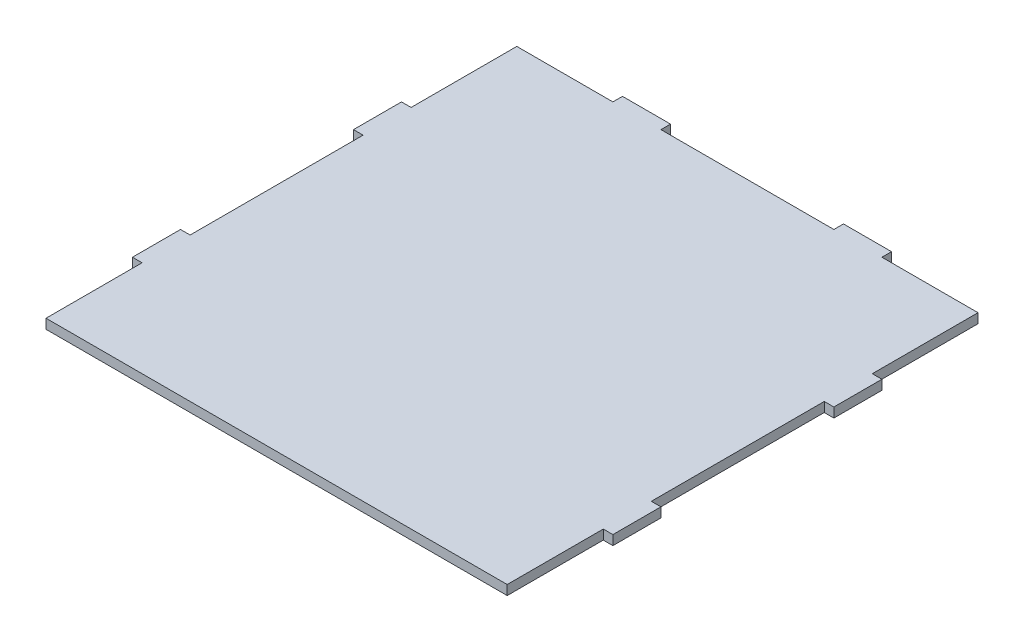
ISO-10303-21;
HEADER;
FILE_DESCRIPTION(('STEP AP214'),'2;1');
FILE_NAME('part.step','',(''),(''),'','','');
FILE_SCHEMA(('AUTOMOTIVE_DESIGN { 1 0 10303 214 1 1 1 1 }'));
ENDSEC;
DATA;
#1=APPLICATION_CONTEXT('core data for automotive mechanical design processes');
#2=APPLICATION_PROTOCOL_DEFINITION('international standard','automotive_design',2000,#1);
#3=PRODUCT_CONTEXT('',#1,'mechanical');
#4=PRODUCT('Part','Part','',(#3));
#5=PRODUCT_RELATED_PRODUCT_CATEGORY('part','',(#4));
#6=PRODUCT_DEFINITION_FORMATION('','',#4);
#7=PRODUCT_DEFINITION_CONTEXT('part definition',#1,'design');
#8=PRODUCT_DEFINITION('design','',#6,#7);
#9=PRODUCT_DEFINITION_SHAPE('','',#8);
#10=(LENGTH_UNIT() NAMED_UNIT(*) SI_UNIT(.MILLI.,.METRE.));
#11=(NAMED_UNIT(*) PLANE_ANGLE_UNIT() SI_UNIT($,.RADIAN.));
#12=(NAMED_UNIT(*) SI_UNIT($,.STERADIAN.) SOLID_ANGLE_UNIT());
#13=UNCERTAINTY_MEASURE_WITH_UNIT(LENGTH_MEASURE(1.E-05),#10,'distance_accuracy_value','');
#14=(GEOMETRIC_REPRESENTATION_CONTEXT(3) GLOBAL_UNCERTAINTY_ASSIGNED_CONTEXT((#13)) GLOBAL_UNIT_ASSIGNED_CONTEXT((#10,
#11,#12)) REPRESENTATION_CONTEXT('',''));
#15=CARTESIAN_POINT('',(0.,0.,0.));
#16=DIRECTION('',(0.,0.,1.));
#17=DIRECTION('',(1.,0.,0.));
#18=AXIS2_PLACEMENT_3D('',#15,#16,#17);
#19=CARTESIAN_POINT('',(0.,0.,0.));
#20=DIRECTION('',(0.,0.,-1.));
#21=DIRECTION('',(-1.,0.,0.));
#22=AXIS2_PLACEMENT_3D('',#19,#20,#21);
#23=PLANE('',#22);
#24=DIRECTION('',(0.,1.,0.));
#25=VECTOR('',#24,1.);
#26=CARTESIAN_POINT('',(28.,-48.,0.));
#27=LINE('',#26,#25);
#28=CARTESIAN_POINT('',(28.,-50.,0.));
#29=VERTEX_POINT('',#28);
#30=CARTESIAN_POINT('',(28.,-48.,0.));
#31=VERTEX_POINT('',#30);
#32=EDGE_CURVE('E50',#29,#31,#27,.T.);
#33=ORIENTED_EDGE('',*,*,#32,.T.);
#34=DIRECTION('',(-1.,0.,0.));
#35=VECTOR('',#34,1.);
#36=CARTESIAN_POINT('',(-48.,-48.,0.));
#37=LINE('',#36,#35);
#38=CARTESIAN_POINT('',(48.,-48.,0.));
#39=VERTEX_POINT('',#38);
#40=EDGE_CURVE('E260',#39,#31,#37,.T.);
#41=ORIENTED_EDGE('',*,*,#40,.F.);
#42=DIRECTION('',(0.,1.,0.));
#43=VECTOR('',#42,1.);
#44=CARTESIAN_POINT('',(48.,-50.,0.));
#45=LINE('',#44,#43);
#46=CARTESIAN_POINT('',(48.,-50.,0.));
#47=VERTEX_POINT('',#46);
#48=EDGE_CURVE('E253',#47,#39,#45,.T.);
#49=ORIENTED_EDGE('',*,*,#48,.F.);
#50=DIRECTION('',(1.,0.,0.));
#51=VECTOR('',#50,1.);
#52=CARTESIAN_POINT('',(-48.,-50.,0.));
#53=LINE('',#52,#51);
#54=EDGE_CURVE('E251',#29,#47,#53,.T.);
#55=ORIENTED_EDGE('',*,*,#54,.F.);
#56=EDGE_LOOP('',(#33,#41,#49,#55));
#57=FACE_BOUND('',#56,.T.);
#58=ADVANCED_FACE('F33',(#57),#23,.T.);
#59=DIRECTION('',(0.,1.,0.));
#60=VECTOR('',#59,1.);
#61=CARTESIAN_POINT('',(-28.,-48.,0.));
#62=LINE('',#61,#60);
#63=CARTESIAN_POINT('',(-28.,-50.,0.));
#64=VERTEX_POINT('',#63);
#65=CARTESIAN_POINT('',(-28.,-48.,0.));
#66=VERTEX_POINT('',#65);
#67=EDGE_CURVE('E58',#64,#66,#62,.T.);
#68=ORIENTED_EDGE('',*,*,#67,.F.);
#69=CARTESIAN_POINT('',(-48.,-50.,0.));
#70=VERTEX_POINT('',#69);
#71=EDGE_CURVE('E250',#70,#64,#53,.T.);
#72=ORIENTED_EDGE('',*,*,#71,.F.);
#73=DIRECTION('',(0.,-1.,0.));
#74=VECTOR('',#73,1.);
#75=CARTESIAN_POINT('',(-48.,-50.,0.));
#76=LINE('',#75,#74);
#77=CARTESIAN_POINT('',(-48.,-48.,0.));
#78=VERTEX_POINT('',#77);
#79=EDGE_CURVE('E254',#78,#70,#76,.T.);
#80=ORIENTED_EDGE('',*,*,#79,.F.);
#81=EDGE_CURVE('E259',#66,#78,#37,.T.);
#82=ORIENTED_EDGE('',*,*,#81,.F.);
#83=EDGE_LOOP('',(#68,#72,#80,#82));
#84=FACE_BOUND('',#83,.T.);
#85=ADVANCED_FACE('F297',(#84),#23,.T.);
#86=CARTESIAN_POINT('',(48.,-50.,194.020831073262));
#87=DIRECTION('',(-1.,0.,0.));
#88=DIRECTION('',(0.,-1.,0.));
#89=AXIS2_PLACEMENT_3D('',#86,#87,#88);
#90=PLANE('',#89);
#91=DIRECTION('',(0.,0.,-1.));
#92=VECTOR('',#91,1.);
#93=CARTESIAN_POINT('',(48.,-48.,194.020831073262));
#94=LINE('',#93,#92);
#95=CARTESIAN_POINT('',(48.,-48.,22.));
#96=VERTEX_POINT('',#95);
#97=EDGE_CURVE('E266',#96,#39,#94,.T.);
#98=ORIENTED_EDGE('',*,*,#97,.F.);
#99=DIRECTION('',(0.,-1.,0.));
#100=VECTOR('',#99,1.);
#101=CARTESIAN_POINT('',(48.,-50.,22.));
#102=LINE('',#101,#100);
#103=CARTESIAN_POINT('',(48.,-50.,22.));
#104=VERTEX_POINT('',#103);
#105=EDGE_CURVE('E432',#96,#104,#102,.T.);
#106=ORIENTED_EDGE('',*,*,#105,.T.);
#107=DIRECTION('',(0.,0.,-1.));
#108=VECTOR('',#107,1.);
#109=CARTESIAN_POINT('',(48.,-50.,194.020831073262));
#110=LINE('',#109,#108);
#111=EDGE_CURVE('E271',#104,#47,#110,.T.);
#112=ORIENTED_EDGE('',*,*,#111,.T.);
#113=ORIENTED_EDGE('',*,*,#48,.T.);
#114=EDGE_LOOP('',(#98,#106,#112,#113));
#115=FACE_BOUND('',#114,.T.);
#116=ADVANCED_FACE('F485',(#115),#90,.F.);
#117=DIRECTION('',(0.,-1.,0.));
#118=VECTOR('',#117,1.);
#119=CARTESIAN_POINT('',(48.,-50.,78.));
#120=LINE('',#119,#118);
#121=CARTESIAN_POINT('',(48.,-48.,78.0000000000001));
#122=VERTEX_POINT('',#121);
#123=CARTESIAN_POINT('',(48.,-50.,78.0000000000001));
#124=VERTEX_POINT('',#123);
#125=EDGE_CURVE('E404',#122,#124,#120,.T.);
#126=ORIENTED_EDGE('',*,*,#125,.F.);
#127=CARTESIAN_POINT('',(48.,-48.,98.));
#128=VERTEX_POINT('',#127);
#129=EDGE_CURVE('E268',#128,#122,#94,.T.);
#130=ORIENTED_EDGE('',*,*,#129,.F.);
#131=DIRECTION('',(0.,-1.,0.));
#132=VECTOR('',#131,1.);
#133=CARTESIAN_POINT('',(48.,-50.,98.));
#134=LINE('',#133,#132);
#135=CARTESIAN_POINT('',(48.,-50.,98.));
#136=VERTEX_POINT('',#135);
#137=EDGE_CURVE('E284',#128,#136,#134,.T.);
#138=ORIENTED_EDGE('',*,*,#137,.T.);
#139=EDGE_CURVE('E273',#136,#124,#110,.T.);
#140=ORIENTED_EDGE('',*,*,#139,.T.);
#141=EDGE_LOOP('',(#126,#130,#138,#140));
#142=FACE_BOUND('',#141,.T.);
#143=ADVANCED_FACE('F538',(#142),#90,.F.);
#144=CARTESIAN_POINT('',(48.,-50.,68.0000000000001));
#145=VERTEX_POINT('',#144);
#146=CARTESIAN_POINT('',(48.,-50.,32.));
#147=VERTEX_POINT('',#146);
#148=EDGE_CURVE('E275',#145,#147,#110,.T.);
#149=ORIENTED_EDGE('',*,*,#148,.T.);
#150=DIRECTION('',(0.,1.,0.));
#151=VECTOR('',#150,1.);
#152=CARTESIAN_POINT('',(48.,-50.,32.));
#153=LINE('',#152,#151);
#154=CARTESIAN_POINT('',(48.,-48.,32.));
#155=VERTEX_POINT('',#154);
#156=EDGE_CURVE('E430',#147,#155,#153,.T.);
#157=ORIENTED_EDGE('',*,*,#156,.T.);
#158=CARTESIAN_POINT('',(48.,-48.,68.));
#159=VERTEX_POINT('',#158);
#160=EDGE_CURVE('E272',#159,#155,#94,.T.);
#161=ORIENTED_EDGE('',*,*,#160,.F.);
#162=DIRECTION('',(0.,1.,0.));
#163=VECTOR('',#162,1.);
#164=CARTESIAN_POINT('',(48.,-50.,68.));
#165=LINE('',#164,#163);
#166=EDGE_CURVE('E401',#145,#159,#165,.T.);
#167=ORIENTED_EDGE('',*,*,#166,.F.);
#168=EDGE_LOOP('',(#149,#157,#161,#167));
#169=FACE_BOUND('',#168,.T.);
#170=ADVANCED_FACE('F489',(#169),#90,.F.);
#171=CARTESIAN_POINT('',(-48.,-50.,194.020831073262));
#172=DIRECTION('',(1.,0.,0.));
#173=DIRECTION('',(0.,0.,-1.));
#174=AXIS2_PLACEMENT_3D('',#171,#172,#173);
#175=PLANE('',#174);
#176=DIRECTION('',(0.,0.,-1.));
#177=VECTOR('',#176,1.);
#178=CARTESIAN_POINT('',(-48.,-50.,194.020831073262));
#179=LINE('',#178,#177);
#180=CARTESIAN_POINT('',(-48.,-50.,22.0000000000001));
#181=VERTEX_POINT('',#180);
#182=EDGE_CURVE('E274',#181,#70,#179,.T.);
#183=ORIENTED_EDGE('',*,*,#182,.F.);
#184=DIRECTION('',(0.,1.,0.));
#185=VECTOR('',#184,1.);
#186=CARTESIAN_POINT('',(-48.,-48.,22.));
#187=LINE('',#186,#185);
#188=CARTESIAN_POINT('',(-48.,-48.,22.));
#189=VERTEX_POINT('',#188);
#190=EDGE_CURVE('E369',#181,#189,#187,.T.);
#191=ORIENTED_EDGE('',*,*,#190,.T.);
#192=DIRECTION('',(0.,0.,-1.));
#193=VECTOR('',#192,1.);
#194=CARTESIAN_POINT('',(-48.,-48.,194.020831073262));
#195=LINE('',#194,#193);
#196=EDGE_CURVE('E263',#189,#78,#195,.T.);
#197=ORIENTED_EDGE('',*,*,#196,.T.);
#198=ORIENTED_EDGE('',*,*,#79,.T.);
#199=EDGE_LOOP('',(#183,#191,#197,#198));
#200=FACE_BOUND('',#199,.T.);
#201=ADVANCED_FACE('F299',(#200),#175,.F.);
#202=DIRECTION('',(0.,1.,0.));
#203=VECTOR('',#202,1.);
#204=CARTESIAN_POINT('',(-48.,-48.,78.));
#205=LINE('',#204,#203);
#206=CARTESIAN_POINT('',(-48.,-50.,78.));
#207=VERTEX_POINT('',#206);
#208=CARTESIAN_POINT('',(-48.,-48.,78.));
#209=VERTEX_POINT('',#208);
#210=EDGE_CURVE('E312',#207,#209,#205,.T.);
#211=ORIENTED_EDGE('',*,*,#210,.F.);
#212=CARTESIAN_POINT('',(-48.,-50.,98.));
#213=VERTEX_POINT('',#212);
#214=EDGE_CURVE('E276',#213,#207,#179,.T.);
#215=ORIENTED_EDGE('',*,*,#214,.F.);
#216=DIRECTION('',(0.,1.,0.));
#217=VECTOR('',#216,1.);
#218=CARTESIAN_POINT('',(-48.,-50.,98.));
#219=LINE('',#218,#217);
#220=CARTESIAN_POINT('',(-48.,-48.,98.));
#221=VERTEX_POINT('',#220);
#222=EDGE_CURVE('E11',#213,#221,#219,.T.);
#223=ORIENTED_EDGE('',*,*,#222,.T.);
#224=EDGE_CURVE('E264',#221,#209,#195,.T.);
#225=ORIENTED_EDGE('',*,*,#224,.T.);
#226=EDGE_LOOP('',(#211,#215,#223,#225));
#227=FACE_BOUND('',#226,.T.);
#228=ADVANCED_FACE('F35',(#227),#175,.F.);
#229=CARTESIAN_POINT('',(-48.,-48.,68.0000000000001));
#230=VERTEX_POINT('',#229);
#231=CARTESIAN_POINT('',(-48.,-48.,32.));
#232=VERTEX_POINT('',#231);
#233=EDGE_CURVE('E267',#230,#232,#195,.T.);
#234=ORIENTED_EDGE('',*,*,#233,.T.);
#235=DIRECTION('',(0.,-1.,0.));
#236=VECTOR('',#235,1.);
#237=CARTESIAN_POINT('',(-48.,-48.,32.));
#238=LINE('',#237,#236);
#239=CARTESIAN_POINT('',(-48.,-50.,32.));
#240=VERTEX_POINT('',#239);
#241=EDGE_CURVE('E366',#232,#240,#238,.T.);
#242=ORIENTED_EDGE('',*,*,#241,.T.);
#243=CARTESIAN_POINT('',(-48.,-50.,68.));
#244=VERTEX_POINT('',#243);
#245=EDGE_CURVE('E278',#244,#240,#179,.T.);
#246=ORIENTED_EDGE('',*,*,#245,.F.);
#247=DIRECTION('',(0.,-1.,0.));
#248=VECTOR('',#247,1.);
#249=CARTESIAN_POINT('',(-48.,-48.,68.));
#250=LINE('',#249,#248);
#251=EDGE_CURVE('E315',#230,#244,#250,.T.);
#252=ORIENTED_EDGE('',*,*,#251,.F.);
#253=EDGE_LOOP('',(#234,#242,#246,#252));
#254=FACE_BOUND('',#253,.T.);
#255=ADVANCED_FACE('F352',(#254),#175,.F.);
#256=DIRECTION('',(0.,-1.,0.));
#257=VECTOR('',#256,1.);
#258=CARTESIAN_POINT('',(18.,-48.,0.));
#259=LINE('',#258,#257);
#260=CARTESIAN_POINT('',(18.,-48.,0.));
#261=VERTEX_POINT('',#260);
#262=CARTESIAN_POINT('',(18.,-50.,0.));
#263=VERTEX_POINT('',#262);
#264=EDGE_CURVE('E227',#261,#263,#259,.T.);
#265=ORIENTED_EDGE('',*,*,#264,.T.);
#266=CARTESIAN_POINT('',(-18.,-50.,0.));
#267=VERTEX_POINT('',#266);
#268=EDGE_CURVE('E239',#267,#263,#53,.T.);
#269=ORIENTED_EDGE('',*,*,#268,.F.);
#270=DIRECTION('',(0.,-1.,0.));
#271=VECTOR('',#270,1.);
#272=CARTESIAN_POINT('',(-18.,-48.,0.));
#273=LINE('',#272,#271);
#274=CARTESIAN_POINT('',(-18.,-48.,0.));
#275=VERTEX_POINT('',#274);
#276=EDGE_CURVE('E452',#275,#267,#273,.T.);
#277=ORIENTED_EDGE('',*,*,#276,.F.);
#278=EDGE_CURVE('E241',#261,#275,#37,.T.);
#279=ORIENTED_EDGE('',*,*,#278,.F.);
#280=EDGE_LOOP('',(#265,#269,#277,#279));
#281=FACE_BOUND('',#280,.T.);
#282=ADVANCED_FACE('F237',(#281),#23,.T.);
#283=CARTESIAN_POINT('',(-48.,-48.,194.020831073262));
#284=DIRECTION('',(0.,-1.,0.));
#285=DIRECTION('',(0.,0.,-1.));
#286=AXIS2_PLACEMENT_3D('',#283,#284,#285);
#287=PLANE('',#286);
#288=ORIENTED_EDGE('',*,*,#224,.F.);
#289=DIRECTION('',(1.,0.,0.));
#290=VECTOR('',#289,1.);
#291=CARTESIAN_POINT('',(-48.,-48.,98.));
#292=LINE('',#291,#290);
#293=EDGE_CURVE('E37',#221,#128,#292,.T.);
#294=ORIENTED_EDGE('',*,*,#293,.T.);
#295=ORIENTED_EDGE('',*,*,#129,.T.);
#296=DIRECTION('',(-1.,0.,0.));
#297=VECTOR('',#296,1.);
#298=CARTESIAN_POINT('',(60.1980390271856,-47.9999999999999,78.));
#299=LINE('',#298,#297);
#300=CARTESIAN_POINT('',(50.,-48.,78.));
#301=VERTEX_POINT('',#300);
#302=EDGE_CURVE('E398',#301,#122,#299,.T.);
#303=ORIENTED_EDGE('',*,*,#302,.F.);
#304=DIRECTION('',(0.,0.,-1.));
#305=VECTOR('',#304,1.);
#306=CARTESIAN_POINT('',(50.,-48.,78.));
#307=LINE('',#306,#305);
#308=CARTESIAN_POINT('',(50.,-48.,68.));
#309=VERTEX_POINT('',#308);
#310=EDGE_CURVE('E386',#301,#309,#307,.T.);
#311=ORIENTED_EDGE('',*,*,#310,.T.);
#312=DIRECTION('',(-1.,0.,0.));
#313=VECTOR('',#312,1.);
#314=CARTESIAN_POINT('',(60.1980390271856,-47.9999999999999,68.));
#315=LINE('',#314,#313);
#316=EDGE_CURVE('E395',#309,#159,#315,.T.);
#317=ORIENTED_EDGE('',*,*,#316,.T.);
#318=ORIENTED_EDGE('',*,*,#160,.T.);
#319=DIRECTION('',(-1.,0.,0.));
#320=VECTOR('',#319,1.);
#321=CARTESIAN_POINT('',(60.1980390271856,-47.9999999999999,32.));
#322=LINE('',#321,#320);
#323=CARTESIAN_POINT('',(50.,-47.9999999999999,32.));
#324=VERTEX_POINT('',#323);
#325=EDGE_CURVE('E421',#324,#155,#322,.T.);
#326=ORIENTED_EDGE('',*,*,#325,.F.);
#327=DIRECTION('',(0.,0.,1.));
#328=VECTOR('',#327,1.);
#329=CARTESIAN_POINT('',(50.,-48.,22.));
#330=LINE('',#329,#328);
#331=CARTESIAN_POINT('',(50.,-48.,22.));
#332=VERTEX_POINT('',#331);
#333=EDGE_CURVE('E437',#332,#324,#330,.T.);
#334=ORIENTED_EDGE('',*,*,#333,.F.);
#335=DIRECTION('',(-1.,0.,0.));
#336=VECTOR('',#335,1.);
#337=CARTESIAN_POINT('',(60.1980390271856,-47.9999999999999,22.));
#338=LINE('',#337,#336);
#339=EDGE_CURVE('E417',#332,#96,#338,.T.);
#340=ORIENTED_EDGE('',*,*,#339,.T.);
#341=ORIENTED_EDGE('',*,*,#97,.T.);
#342=ORIENTED_EDGE('',*,*,#40,.T.);
#343=DIRECTION('',(0.,0.,1.));
#344=VECTOR('',#343,1.);
#345=CARTESIAN_POINT('',(28.,-48.,-12.1980390271856));
#346=LINE('',#345,#344);
#347=CARTESIAN_POINT('',(28.,-48.,-2.));
#348=VERTEX_POINT('',#347);
#349=EDGE_CURVE('E242',#348,#31,#346,.T.);
#350=ORIENTED_EDGE('',*,*,#349,.F.);
#351=DIRECTION('',(1.,0.,0.));
#352=VECTOR('',#351,1.);
#353=CARTESIAN_POINT('',(28.,-48.,-2.));
#354=LINE('',#353,#352);
#355=CARTESIAN_POINT('',(18.,-48.,-2.));
#356=VERTEX_POINT('',#355);
#357=EDGE_CURVE('E455',#356,#348,#354,.T.);
#358=ORIENTED_EDGE('',*,*,#357,.F.);
#359=DIRECTION('',(0.,0.,1.));
#360=VECTOR('',#359,1.);
#361=CARTESIAN_POINT('',(18.,-48.,-12.1980390271856));
#362=LINE('',#361,#360);
#363=EDGE_CURVE('E234',#356,#261,#362,.T.);
#364=ORIENTED_EDGE('',*,*,#363,.T.);
#365=ORIENTED_EDGE('',*,*,#278,.T.);
#366=DIRECTION('',(0.,0.,1.));
#367=VECTOR('',#366,1.);
#368=CARTESIAN_POINT('',(-18.,-48.,-12.1980390271856));
#369=LINE('',#368,#367);
#370=CARTESIAN_POINT('',(-18.,-48.,-2.));
#371=VERTEX_POINT('',#370);
#372=EDGE_CURVE('E446',#371,#275,#369,.T.);
#373=ORIENTED_EDGE('',*,*,#372,.F.);
#374=DIRECTION('',(-1.,0.,0.));
#375=VECTOR('',#374,1.);
#376=CARTESIAN_POINT('',(-28.,-48.,-2.));
#377=LINE('',#376,#375);
#378=CARTESIAN_POINT('',(-28.,-48.,-2.));
#379=VERTEX_POINT('',#378);
#380=EDGE_CURVE('E458',#371,#379,#377,.T.);
#381=ORIENTED_EDGE('',*,*,#380,.T.);
#382=DIRECTION('',(0.,0.,1.));
#383=VECTOR('',#382,1.);
#384=CARTESIAN_POINT('',(-28.,-48.,-12.1980390271856));
#385=LINE('',#384,#383);
#386=EDGE_CURVE('E443',#379,#66,#385,.T.);
#387=ORIENTED_EDGE('',*,*,#386,.T.);
#388=ORIENTED_EDGE('',*,*,#81,.T.);
#389=ORIENTED_EDGE('',*,*,#196,.F.);
#390=DIRECTION('',(1.,0.,0.));
#391=VECTOR('',#390,1.);
#392=CARTESIAN_POINT('',(-60.1980390271856,-48.,22.));
#393=LINE('',#392,#391);
#394=CARTESIAN_POINT('',(-50.,-48.,22.));
#395=VERTEX_POINT('',#394);
#396=EDGE_CURVE('E364',#395,#189,#393,.T.);
#397=ORIENTED_EDGE('',*,*,#396,.F.);
#398=DIRECTION('',(0.,0.,-1.));
#399=VECTOR('',#398,1.);
#400=CARTESIAN_POINT('',(-50.,-48.,22.));
#401=LINE('',#400,#399);
#402=CARTESIAN_POINT('',(-50.,-48.,32.));
#403=VERTEX_POINT('',#402);
#404=EDGE_CURVE('E316',#403,#395,#401,.T.);
#405=ORIENTED_EDGE('',*,*,#404,.F.);
#406=DIRECTION('',(1.,0.,0.));
#407=VECTOR('',#406,1.);
#408=CARTESIAN_POINT('',(-60.1980390271856,-48.,32.));
#409=LINE('',#408,#407);
#410=EDGE_CURVE('E358',#403,#232,#409,.T.);
#411=ORIENTED_EDGE('',*,*,#410,.T.);
#412=ORIENTED_EDGE('',*,*,#233,.F.);
#413=DIRECTION('',(1.,0.,0.));
#414=VECTOR('',#413,1.);
#415=CARTESIAN_POINT('',(-60.1980390271856,-48.,68.));
#416=LINE('',#415,#414);
#417=CARTESIAN_POINT('',(-50.,-48.,68.));
#418=VERTEX_POINT('',#417);
#419=EDGE_CURVE('E324',#418,#230,#416,.T.);
#420=ORIENTED_EDGE('',*,*,#419,.F.);
#421=DIRECTION('',(0.,0.,1.));
#422=VECTOR('',#421,1.);
#423=CARTESIAN_POINT('',(-50.,-48.,78.));
#424=LINE('',#423,#422);
#425=CARTESIAN_POINT('',(-50.,-48.,78.));
#426=VERTEX_POINT('',#425);
#427=EDGE_CURVE('E303',#418,#426,#424,.T.);
#428=ORIENTED_EDGE('',*,*,#427,.T.);
#429=DIRECTION('',(1.,0.,0.));
#430=VECTOR('',#429,1.);
#431=CARTESIAN_POINT('',(-60.1980390271856,-48.,78.));
#432=LINE('',#431,#430);
#433=EDGE_CURVE('E327',#426,#209,#432,.T.);
#434=ORIENTED_EDGE('',*,*,#433,.T.);
#435=EDGE_LOOP('',(#288,#294,#295,#303,#311,#317,#318,#326,#334,#340,#341,#342,#350,#358,#364,
#365,#373,#381,#387,#388,#389,#397,#405,#411,#412,#420,#428,#434));
#436=FACE_BOUND('',#435,.T.);
#437=ADVANCED_FACE('F355',(#436),#287,.F.);
#438=CARTESIAN_POINT('',(-48.,-50.,194.020831073262));
#439=DIRECTION('',(0.,1.,0.));
#440=DIRECTION('',(0.,0.,1.));
#441=AXIS2_PLACEMENT_3D('',#438,#439,#440);
#442=PLANE('',#441);
#443=ORIENTED_EDGE('',*,*,#139,.F.);
#444=DIRECTION('',(-1.,0.,0.));
#445=VECTOR('',#444,1.);
#446=CARTESIAN_POINT('',(-48.,-50.,98.));
#447=LINE('',#446,#445);
#448=EDGE_CURVE('E42',#136,#213,#447,.T.);
#449=ORIENTED_EDGE('',*,*,#448,.T.);
#450=ORIENTED_EDGE('',*,*,#214,.T.);
#451=DIRECTION('',(1.,0.,0.));
#452=VECTOR('',#451,1.);
#453=CARTESIAN_POINT('',(-60.1980390271856,-50.,78.));
#454=LINE('',#453,#452);
#455=CARTESIAN_POINT('',(-50.,-50.,78.));
#456=VERTEX_POINT('',#455);
#457=EDGE_CURVE('E319',#456,#207,#454,.T.);
#458=ORIENTED_EDGE('',*,*,#457,.F.);
#459=DIRECTION('',(0.,0.,-1.));
#460=VECTOR('',#459,1.);
#461=CARTESIAN_POINT('',(-50.,-50.,78.));
#462=LINE('',#461,#460);
#463=CARTESIAN_POINT('',(-50.,-50.,68.));
#464=VERTEX_POINT('',#463);
#465=EDGE_CURVE('E330',#456,#464,#462,.T.);
#466=ORIENTED_EDGE('',*,*,#465,.T.);
#467=DIRECTION('',(1.,0.,0.));
#468=VECTOR('',#467,1.);
#469=CARTESIAN_POINT('',(-60.1980390271856,-50.,68.));
#470=LINE('',#469,#468);
#471=EDGE_CURVE('E321',#464,#244,#470,.T.);
#472=ORIENTED_EDGE('',*,*,#471,.T.);
#473=ORIENTED_EDGE('',*,*,#245,.T.);
#474=DIRECTION('',(1.,0.,0.));
#475=VECTOR('',#474,1.);
#476=CARTESIAN_POINT('',(-60.1980390271856,-50.,32.));
#477=LINE('',#476,#475);
#478=CARTESIAN_POINT('',(-50.,-50.,32.));
#479=VERTEX_POINT('',#478);
#480=EDGE_CURVE('E363',#479,#240,#477,.T.);
#481=ORIENTED_EDGE('',*,*,#480,.F.);
#482=DIRECTION('',(0.,0.,1.));
#483=VECTOR('',#482,1.);
#484=CARTESIAN_POINT('',(-50.,-50.,22.));
#485=LINE('',#484,#483);
#486=CARTESIAN_POINT('',(-50.,-50.,22.));
#487=VERTEX_POINT('',#486);
#488=EDGE_CURVE('E382',#487,#479,#485,.T.);
#489=ORIENTED_EDGE('',*,*,#488,.F.);
#490=DIRECTION('',(1.,0.,0.));
#491=VECTOR('',#490,1.);
#492=CARTESIAN_POINT('',(-60.1980390271856,-50.,22.));
#493=LINE('',#492,#491);
#494=EDGE_CURVE('E292',#487,#181,#493,.T.);
#495=ORIENTED_EDGE('',*,*,#494,.T.);
#496=ORIENTED_EDGE('',*,*,#182,.T.);
#497=ORIENTED_EDGE('',*,*,#71,.T.);
#498=DIRECTION('',(0.,0.,1.));
#499=VECTOR('',#498,1.);
#500=CARTESIAN_POINT('',(-28.,-50.,-12.1980390271856));
#501=LINE('',#500,#499);
#502=CARTESIAN_POINT('',(-28.,-50.,-2.));
#503=VERTEX_POINT('',#502);
#504=EDGE_CURVE('E450',#503,#64,#501,.T.);
#505=ORIENTED_EDGE('',*,*,#504,.F.);
#506=DIRECTION('',(1.,0.,0.));
#507=VECTOR('',#506,1.);
#508=CARTESIAN_POINT('',(-28.,-50.,-2.));
#509=LINE('',#508,#507);
#510=CARTESIAN_POINT('',(-18.,-50.,-2.));
#511=VERTEX_POINT('',#510);
#512=EDGE_CURVE('E440',#503,#511,#509,.T.);
#513=ORIENTED_EDGE('',*,*,#512,.T.);
#514=DIRECTION('',(0.,0.,1.));
#515=VECTOR('',#514,1.);
#516=CARTESIAN_POINT('',(-18.,-50.,-12.1980390271856));
#517=LINE('',#516,#515);
#518=EDGE_CURVE('E248',#511,#267,#517,.T.);
#519=ORIENTED_EDGE('',*,*,#518,.T.);
#520=ORIENTED_EDGE('',*,*,#268,.T.);
#521=DIRECTION('',(0.,0.,1.));
#522=VECTOR('',#521,1.);
#523=CARTESIAN_POINT('',(18.,-50.,-12.1980390271856));
#524=LINE('',#523,#522);
#525=CARTESIAN_POINT('',(18.,-50.,-2.));
#526=VERTEX_POINT('',#525);
#527=EDGE_CURVE('E223',#526,#263,#524,.T.);
#528=ORIENTED_EDGE('',*,*,#527,.F.);
#529=DIRECTION('',(-1.,0.,0.));
#530=VECTOR('',#529,1.);
#531=CARTESIAN_POINT('',(28.,-50.,-2.));
#532=LINE('',#531,#530);
#533=CARTESIAN_POINT('',(28.,-50.,-2.));
#534=VERTEX_POINT('',#533);
#535=EDGE_CURVE('E470',#534,#526,#532,.T.);
#536=ORIENTED_EDGE('',*,*,#535,.F.);
#537=DIRECTION('',(0.,0.,1.));
#538=VECTOR('',#537,1.);
#539=CARTESIAN_POINT('',(28.,-50.,-12.1980390271856));
#540=LINE('',#539,#538);
#541=EDGE_CURVE('E233',#534,#29,#540,.T.);
#542=ORIENTED_EDGE('',*,*,#541,.T.);
#543=ORIENTED_EDGE('',*,*,#54,.T.);
#544=ORIENTED_EDGE('',*,*,#111,.F.);
#545=DIRECTION('',(-1.,0.,0.));
#546=VECTOR('',#545,1.);
#547=CARTESIAN_POINT('',(60.1980390271856,-49.9999999999999,22.));
#548=LINE('',#547,#546);
#549=CARTESIAN_POINT('',(50.,-50.,22.));
#550=VERTEX_POINT('',#549);
#551=EDGE_CURVE('E427',#550,#104,#548,.T.);
#552=ORIENTED_EDGE('',*,*,#551,.F.);
#553=DIRECTION('',(0.,0.,-1.));
#554=VECTOR('',#553,1.);
#555=CARTESIAN_POINT('',(50.,-50.,22.));
#556=LINE('',#555,#554);
#557=CARTESIAN_POINT('',(50.,-50.,32.));
#558=VERTEX_POINT('',#557);
#559=EDGE_CURVE('E407',#558,#550,#556,.T.);
#560=ORIENTED_EDGE('',*,*,#559,.F.);
#561=DIRECTION('',(-1.,0.,0.));
#562=VECTOR('',#561,1.);
#563=CARTESIAN_POINT('',(60.1980390271856,-49.9999999999999,32.));
#564=LINE('',#563,#562);
#565=EDGE_CURVE('E424',#558,#147,#564,.T.);
#566=ORIENTED_EDGE('',*,*,#565,.T.);
#567=ORIENTED_EDGE('',*,*,#148,.F.);
#568=DIRECTION('',(-1.,0.,0.));
#569=VECTOR('',#568,1.);
#570=CARTESIAN_POINT('',(60.1980390271856,-49.9999999999999,68.));
#571=LINE('',#570,#569);
#572=CARTESIAN_POINT('',(50.,-50.,68.));
#573=VERTEX_POINT('',#572);
#574=EDGE_CURVE('E392',#573,#145,#571,.T.);
#575=ORIENTED_EDGE('',*,*,#574,.F.);
#576=DIRECTION('',(0.,0.,1.));
#577=VECTOR('',#576,1.);
#578=CARTESIAN_POINT('',(50.,-50.,78.));
#579=LINE('',#578,#577);
#580=CARTESIAN_POINT('',(50.,-50.,78.));
#581=VERTEX_POINT('',#580);
#582=EDGE_CURVE('E410',#573,#581,#579,.T.);
#583=ORIENTED_EDGE('',*,*,#582,.T.);
#584=DIRECTION('',(-1.,0.,0.));
#585=VECTOR('',#584,1.);
#586=CARTESIAN_POINT('',(60.1980390271856,-49.9999999999999,78.));
#587=LINE('',#586,#585);
#588=EDGE_CURVE('E390',#581,#124,#587,.T.);
#589=ORIENTED_EDGE('',*,*,#588,.T.);
#590=EDGE_LOOP('',(#443,#449,#450,#458,#466,#472,#473,#481,#489,#495,#496,#497,#505,#513,#519,
#520,#528,#536,#542,#543,#544,#552,#560,#566,#567,#575,#583,#589));
#591=FACE_BOUND('',#590,.T.);
#592=ADVANCED_FACE('F245',(#591),#442,.F.);
#593=CARTESIAN_POINT('',(0.,0.,98.));
#594=DIRECTION('',(0.,0.,-1.));
#595=DIRECTION('',(-1.,0.,0.));
#596=AXIS2_PLACEMENT_3D('',#593,#594,#595);
#597=PLANE('',#596);
#598=ORIENTED_EDGE('',*,*,#448,.F.);
#599=ORIENTED_EDGE('',*,*,#137,.F.);
#600=ORIENTED_EDGE('',*,*,#293,.F.);
#601=ORIENTED_EDGE('',*,*,#222,.F.);
#602=EDGE_LOOP('',(#598,#599,#600,#601));
#603=FACE_BOUND('',#602,.T.);
#604=ADVANCED_FACE('F337',(#603),#597,.F.);
#605=CARTESIAN_POINT('',(-60.1980390271856,-48.,68.));
#606=DIRECTION('',(0.,0.,1.));
#607=DIRECTION('',(1.,0.,0.));
#608=AXIS2_PLACEMENT_3D('',#605,#606,#607);
#609=PLANE('',#608);
#610=ORIENTED_EDGE('',*,*,#471,.F.);
#611=DIRECTION('',(0.,1.,0.));
#612=VECTOR('',#611,1.);
#613=CARTESIAN_POINT('',(-50.,-48.,68.));
#614=LINE('',#613,#612);
#615=EDGE_CURVE('E308',#464,#418,#614,.T.);
#616=ORIENTED_EDGE('',*,*,#615,.T.);
#617=ORIENTED_EDGE('',*,*,#419,.T.);
#618=ORIENTED_EDGE('',*,*,#251,.T.);
#619=EDGE_LOOP('',(#610,#616,#617,#618));
#620=FACE_BOUND('',#619,.T.);
#621=ADVANCED_FACE('F348',(#620),#609,.F.);
#622=CARTESIAN_POINT('',(-60.1980390271856,-48.,78.));
#623=DIRECTION('',(0.,0.,-1.));
#624=DIRECTION('',(-1.,0.,0.));
#625=AXIS2_PLACEMENT_3D('',#622,#623,#624);
#626=PLANE('',#625);
#627=ORIENTED_EDGE('',*,*,#433,.F.);
#628=DIRECTION('',(0.,-1.,0.));
#629=VECTOR('',#628,1.);
#630=CARTESIAN_POINT('',(-50.,-48.,78.));
#631=LINE('',#630,#629);
#632=EDGE_CURVE('E301',#426,#456,#631,.T.);
#633=ORIENTED_EDGE('',*,*,#632,.T.);
#634=ORIENTED_EDGE('',*,*,#457,.T.);
#635=ORIENTED_EDGE('',*,*,#210,.T.);
#636=EDGE_LOOP('',(#627,#633,#634,#635));
#637=FACE_BOUND('',#636,.T.);
#638=ADVANCED_FACE('F341',(#637),#626,.F.);
#639=CARTESIAN_POINT('',(-50.,50.,198.0199980004));
#640=DIRECTION('',(1.,0.,0.));
#641=DIRECTION('',(0.,0.,-1.));
#642=AXIS2_PLACEMENT_3D('',#639,#640,#641);
#643=PLANE('',#642);
#644=ORIENTED_EDGE('',*,*,#427,.F.);
#645=ORIENTED_EDGE('',*,*,#615,.F.);
#646=ORIENTED_EDGE('',*,*,#465,.F.);
#647=ORIENTED_EDGE('',*,*,#632,.F.);
#648=EDGE_LOOP('',(#644,#645,#646,#647));
#649=FACE_BOUND('',#648,.T.);
#650=ADVANCED_FACE('F344',(#649),#643,.F.);
#651=CARTESIAN_POINT('',(-60.1980390271856,-48.,22.));
#652=DIRECTION('',(0.,0.,-1.));
#653=DIRECTION('',(-1.,0.,0.));
#654=AXIS2_PLACEMENT_3D('',#651,#652,#653);
#655=PLANE('',#654);
#656=DIRECTION('',(0.,-1.,0.));
#657=VECTOR('',#656,1.);
#658=CARTESIAN_POINT('',(-50.,-48.,22.));
#659=LINE('',#658,#657);
#660=EDGE_CURVE('E379',#395,#487,#659,.T.);
#661=ORIENTED_EDGE('',*,*,#660,.F.);
#662=ORIENTED_EDGE('',*,*,#396,.T.);
#663=ORIENTED_EDGE('',*,*,#190,.F.);
#664=ORIENTED_EDGE('',*,*,#494,.F.);
#665=EDGE_LOOP('',(#661,#662,#663,#664));
#666=FACE_BOUND('',#665,.T.);
#667=ADVANCED_FACE('F710',(#666),#655,.T.);
#668=CARTESIAN_POINT('',(-60.1980390271856,-48.,32.));
#669=DIRECTION('',(0.,0.,1.));
#670=DIRECTION('',(1.,0.,0.));
#671=AXIS2_PLACEMENT_3D('',#668,#669,#670);
#672=PLANE('',#671);
#673=DIRECTION('',(0.,1.,0.));
#674=VECTOR('',#673,1.);
#675=CARTESIAN_POINT('',(-50.,-48.,32.));
#676=LINE('',#675,#674);
#677=EDGE_CURVE('E378',#479,#403,#676,.T.);
#678=ORIENTED_EDGE('',*,*,#677,.F.);
#679=ORIENTED_EDGE('',*,*,#480,.T.);
#680=ORIENTED_EDGE('',*,*,#241,.F.);
#681=ORIENTED_EDGE('',*,*,#410,.F.);
#682=EDGE_LOOP('',(#678,#679,#680,#681));
#683=FACE_BOUND('',#682,.T.);
#684=ADVANCED_FACE('F367',(#683),#672,.T.);
#685=CARTESIAN_POINT('',(-50.,50.,198.0199980004));
#686=DIRECTION('',(1.,0.,0.));
#687=DIRECTION('',(0.,0.,-1.));
#688=AXIS2_PLACEMENT_3D('',#685,#686,#687);
#689=PLANE('',#688);
#690=ORIENTED_EDGE('',*,*,#660,.T.);
#691=ORIENTED_EDGE('',*,*,#488,.T.);
#692=ORIENTED_EDGE('',*,*,#677,.T.);
#693=ORIENTED_EDGE('',*,*,#404,.T.);
#694=EDGE_LOOP('',(#690,#691,#692,#693));
#695=FACE_BOUND('',#694,.T.);
#696=ADVANCED_FACE('F562',(#695),#689,.F.);
#697=CARTESIAN_POINT('',(60.1980390271856,-49.9999999999999,68.));
#698=DIRECTION('',(0.,0.,1.));
#699=DIRECTION('',(1.,0.,0.));
#700=AXIS2_PLACEMENT_3D('',#697,#698,#699);
#701=PLANE('',#700);
#702=ORIENTED_EDGE('',*,*,#316,.F.);
#703=DIRECTION('',(0.,-1.,0.));
#704=VECTOR('',#703,1.);
#705=CARTESIAN_POINT('',(50.,-49.9999999999999,68.));
#706=LINE('',#705,#704);
#707=EDGE_CURVE('E389',#309,#573,#706,.T.);
#708=ORIENTED_EDGE('',*,*,#707,.T.);
#709=ORIENTED_EDGE('',*,*,#574,.T.);
#710=ORIENTED_EDGE('',*,*,#166,.T.);
#711=EDGE_LOOP('',(#702,#708,#709,#710));
#712=FACE_BOUND('',#711,.T.);
#713=ADVANCED_FACE('F567',(#712),#701,.F.);
#714=CARTESIAN_POINT('',(60.1980390271856,-49.9999999999999,78.));
#715=DIRECTION('',(0.,0.,-1.));
#716=DIRECTION('',(-1.,0.,0.));
#717=AXIS2_PLACEMENT_3D('',#714,#715,#716);
#718=PLANE('',#717);
#719=ORIENTED_EDGE('',*,*,#588,.F.);
#720=DIRECTION('',(0.,1.,0.));
#721=VECTOR('',#720,1.);
#722=CARTESIAN_POINT('',(50.,-49.9999999999999,78.));
#723=LINE('',#722,#721);
#724=EDGE_CURVE('E372',#581,#301,#723,.T.);
#725=ORIENTED_EDGE('',*,*,#724,.T.);
#726=ORIENTED_EDGE('',*,*,#302,.T.);
#727=ORIENTED_EDGE('',*,*,#125,.T.);
#728=EDGE_LOOP('',(#719,#725,#726,#727));
#729=FACE_BOUND('',#728,.T.);
#730=ADVANCED_FACE('F572',(#729),#718,.F.);
#731=CARTESIAN_POINT('',(50.,50.,98.));
#732=DIRECTION('',(-1.,0.,0.));
#733=DIRECTION('',(0.,0.,1.));
#734=AXIS2_PLACEMENT_3D('',#731,#732,#733);
#735=PLANE('',#734);
#736=ORIENTED_EDGE('',*,*,#582,.F.);
#737=ORIENTED_EDGE('',*,*,#707,.F.);
#738=ORIENTED_EDGE('',*,*,#310,.F.);
#739=ORIENTED_EDGE('',*,*,#724,.F.);
#740=EDGE_LOOP('',(#736,#737,#738,#739));
#741=FACE_BOUND('',#740,.T.);
#742=ADVANCED_FACE('F582',(#741),#735,.F.);
#743=CARTESIAN_POINT('',(60.1980390271856,-49.9999999999999,22.));
#744=DIRECTION('',(0.,0.,-1.));
#745=DIRECTION('',(-1.,0.,0.));
#746=AXIS2_PLACEMENT_3D('',#743,#744,#745);
#747=PLANE('',#746);
#748=DIRECTION('',(0.,1.,0.));
#749=VECTOR('',#748,1.);
#750=CARTESIAN_POINT('',(50.,-49.9999999999999,22.));
#751=LINE('',#750,#749);
#752=EDGE_CURVE('E416',#550,#332,#751,.T.);
#753=ORIENTED_EDGE('',*,*,#752,.F.);
#754=ORIENTED_EDGE('',*,*,#551,.T.);
#755=ORIENTED_EDGE('',*,*,#105,.F.);
#756=ORIENTED_EDGE('',*,*,#339,.F.);
#757=EDGE_LOOP('',(#753,#754,#755,#756));
#758=FACE_BOUND('',#757,.T.);
#759=ADVANCED_FACE('F504',(#758),#747,.T.);
#760=CARTESIAN_POINT('',(60.1980390271856,-49.9999999999999,32.));
#761=DIRECTION('',(0.,0.,1.));
#762=DIRECTION('',(1.,0.,0.));
#763=AXIS2_PLACEMENT_3D('',#760,#761,#762);
#764=PLANE('',#763);
#765=DIRECTION('',(0.,-1.,0.));
#766=VECTOR('',#765,1.);
#767=CARTESIAN_POINT('',(50.,-49.9999999999999,32.));
#768=LINE('',#767,#766);
#769=EDGE_CURVE('E420',#324,#558,#768,.T.);
#770=ORIENTED_EDGE('',*,*,#769,.F.);
#771=ORIENTED_EDGE('',*,*,#325,.T.);
#772=ORIENTED_EDGE('',*,*,#156,.F.);
#773=ORIENTED_EDGE('',*,*,#565,.F.);
#774=EDGE_LOOP('',(#770,#771,#772,#773));
#775=FACE_BOUND('',#774,.T.);
#776=ADVANCED_FACE('F497',(#775),#764,.T.);
#777=CARTESIAN_POINT('',(50.,50.,98.));
#778=DIRECTION('',(-1.,0.,0.));
#779=DIRECTION('',(0.,0.,1.));
#780=AXIS2_PLACEMENT_3D('',#777,#778,#779);
#781=PLANE('',#780);
#782=ORIENTED_EDGE('',*,*,#752,.T.);
#783=ORIENTED_EDGE('',*,*,#333,.T.);
#784=ORIENTED_EDGE('',*,*,#769,.T.);
#785=ORIENTED_EDGE('',*,*,#559,.T.);
#786=EDGE_LOOP('',(#782,#783,#784,#785));
#787=FACE_BOUND('',#786,.T.);
#788=ADVANCED_FACE('F506',(#787),#781,.F.);
#789=CARTESIAN_POINT('',(-18.,-48.,-12.1980390271856));
#790=DIRECTION('',(-1.,0.,0.));
#791=DIRECTION('',(0.,-1.,0.));
#792=AXIS2_PLACEMENT_3D('',#789,#790,#791);
#793=PLANE('',#792);
#794=ORIENTED_EDGE('',*,*,#518,.F.);
#795=DIRECTION('',(0.,1.,0.));
#796=VECTOR('',#795,1.);
#797=CARTESIAN_POINT('',(-18.,-48.,-2.));
#798=LINE('',#797,#796);
#799=EDGE_CURVE('E442',#511,#371,#798,.T.);
#800=ORIENTED_EDGE('',*,*,#799,.T.);
#801=ORIENTED_EDGE('',*,*,#372,.T.);
#802=ORIENTED_EDGE('',*,*,#276,.T.);
#803=EDGE_LOOP('',(#794,#800,#801,#802));
#804=FACE_BOUND('',#803,.T.);
#805=ADVANCED_FACE('F508',(#804),#793,.F.);
#806=CARTESIAN_POINT('',(-28.,-48.,-12.1980390271856));
#807=DIRECTION('',(1.,0.,0.));
#808=DIRECTION('',(0.,1.,0.));
#809=AXIS2_PLACEMENT_3D('',#806,#807,#808);
#810=PLANE('',#809);
#811=ORIENTED_EDGE('',*,*,#386,.F.);
#812=DIRECTION('',(0.,-1.,0.));
#813=VECTOR('',#812,1.);
#814=CARTESIAN_POINT('',(-28.,-48.,-2.));
#815=LINE('',#814,#813);
#816=EDGE_CURVE('E435',#379,#503,#815,.T.);
#817=ORIENTED_EDGE('',*,*,#816,.T.);
#818=ORIENTED_EDGE('',*,*,#504,.T.);
#819=ORIENTED_EDGE('',*,*,#67,.T.);
#820=EDGE_LOOP('',(#811,#817,#818,#819));
#821=FACE_BOUND('',#820,.T.);
#822=ADVANCED_FACE('F514',(#821),#810,.F.);
#823=CARTESIAN_POINT('',(0.,0.,-2.));
#824=DIRECTION('',(0.,0.,1.));
#825=DIRECTION('',(0.,-1.,0.));
#826=AXIS2_PLACEMENT_3D('',#823,#824,#825);
#827=PLANE('',#826);
#828=ORIENTED_EDGE('',*,*,#380,.F.);
#829=ORIENTED_EDGE('',*,*,#799,.F.);
#830=ORIENTED_EDGE('',*,*,#512,.F.);
#831=ORIENTED_EDGE('',*,*,#816,.F.);
#832=EDGE_LOOP('',(#828,#829,#830,#831));
#833=FACE_BOUND('',#832,.T.);
#834=ADVANCED_FACE('F629',(#833),#827,.F.);
#835=CARTESIAN_POINT('',(28.,-48.,-12.1980390271856));
#836=DIRECTION('',(1.,0.,0.));
#837=DIRECTION('',(0.,1.,0.));
#838=AXIS2_PLACEMENT_3D('',#835,#836,#837);
#839=PLANE('',#838);
#840=DIRECTION('',(0.,-1.,0.));
#841=VECTOR('',#840,1.);
#842=CARTESIAN_POINT('',(28.,-48.,-2.));
#843=LINE('',#842,#841);
#844=EDGE_CURVE('E464',#348,#534,#843,.T.);
#845=ORIENTED_EDGE('',*,*,#844,.F.);
#846=ORIENTED_EDGE('',*,*,#349,.T.);
#847=ORIENTED_EDGE('',*,*,#32,.F.);
#848=ORIENTED_EDGE('',*,*,#541,.F.);
#849=EDGE_LOOP('',(#845,#846,#847,#848));
#850=FACE_BOUND('',#849,.T.);
#851=ADVANCED_FACE('F478',(#850),#839,.T.);
#852=CARTESIAN_POINT('',(18.,-48.,-12.1980390271856));
#853=DIRECTION('',(-1.,0.,0.));
#854=DIRECTION('',(0.,-1.,0.));
#855=AXIS2_PLACEMENT_3D('',#852,#853,#854);
#856=PLANE('',#855);
#857=DIRECTION('',(0.,1.,0.));
#858=VECTOR('',#857,1.);
#859=CARTESIAN_POINT('',(18.,-48.,-2.));
#860=LINE('',#859,#858);
#861=EDGE_CURVE('E229',#526,#356,#860,.T.);
#862=ORIENTED_EDGE('',*,*,#861,.F.);
#863=ORIENTED_EDGE('',*,*,#527,.T.);
#864=ORIENTED_EDGE('',*,*,#264,.F.);
#865=ORIENTED_EDGE('',*,*,#363,.F.);
#866=EDGE_LOOP('',(#862,#863,#864,#865));
#867=FACE_BOUND('',#866,.T.);
#868=ADVANCED_FACE('F225',(#867),#856,.T.);
#869=CARTESIAN_POINT('',(0.,0.,-2.));
#870=DIRECTION('',(0.,0.,1.));
#871=DIRECTION('',(0.,-1.,0.));
#872=AXIS2_PLACEMENT_3D('',#869,#870,#871);
#873=PLANE('',#872);
#874=ORIENTED_EDGE('',*,*,#844,.T.);
#875=ORIENTED_EDGE('',*,*,#535,.T.);
#876=ORIENTED_EDGE('',*,*,#861,.T.);
#877=ORIENTED_EDGE('',*,*,#357,.T.);
#878=EDGE_LOOP('',(#874,#875,#876,#877));
#879=FACE_BOUND('',#878,.T.);
#880=ADVANCED_FACE('F473',(#879),#873,.F.);
#881=CLOSED_SHELL('',(#58,#85,#116,#143,#170,#201,#228,#255,#282,#437,#592,#604,#621,#638,#650,
#667,#684,#696,#713,#730,#742,#759,#776,#788,#805,#822,#834,#851,#868,#880));
#882=MANIFOLD_SOLID_BREP('B2',#881);
#883=ADVANCED_BREP_SHAPE_REPRESENTATION('',(#18,#882),#14);
#884=SHAPE_DEFINITION_REPRESENTATION(#9,#883);
ENDSEC;
END-ISO-10303-21;
